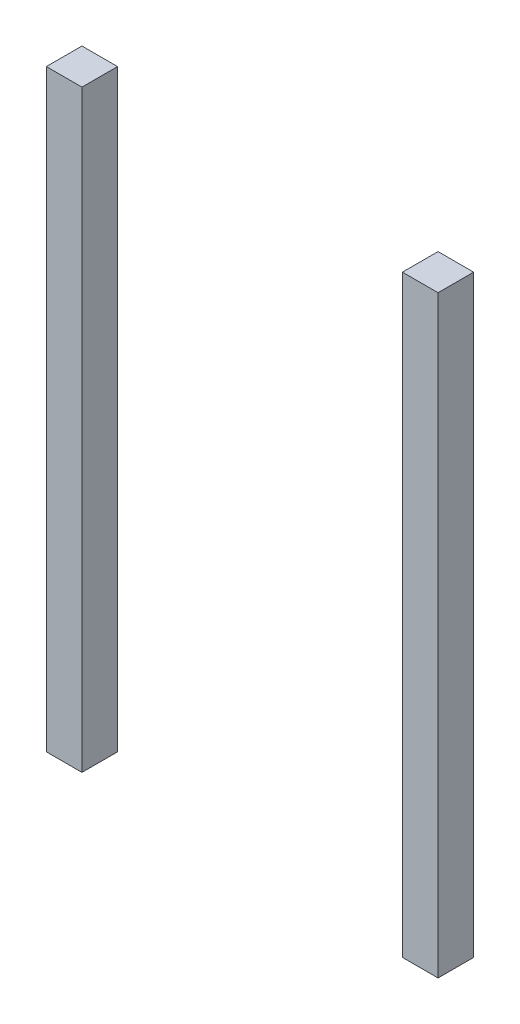
ISO-10303-21;
HEADER;
FILE_DESCRIPTION(('STEP AP214'),'2;1');
FILE_NAME('part.step','',(''),(''),'','','');
FILE_SCHEMA(('AUTOMOTIVE_DESIGN { 1 0 10303 214 1 1 1 1 }'));
ENDSEC;
DATA;
#1=APPLICATION_CONTEXT('core data for automotive mechanical design processes');
#2=APPLICATION_PROTOCOL_DEFINITION('international standard','automotive_design',2000,#1);
#3=PRODUCT_CONTEXT('',#1,'mechanical');
#4=PRODUCT('Part','Part','',(#3));
#5=PRODUCT_RELATED_PRODUCT_CATEGORY('part','',(#4));
#6=PRODUCT_DEFINITION_FORMATION('','',#4);
#7=PRODUCT_DEFINITION_CONTEXT('part definition',#1,'design');
#8=PRODUCT_DEFINITION('design','',#6,#7);
#9=PRODUCT_DEFINITION_SHAPE('','',#8);
#10=(LENGTH_UNIT() NAMED_UNIT(*) SI_UNIT(.MILLI.,.METRE.));
#11=(NAMED_UNIT(*) PLANE_ANGLE_UNIT() SI_UNIT($,.RADIAN.));
#12=(NAMED_UNIT(*) SI_UNIT($,.STERADIAN.) SOLID_ANGLE_UNIT());
#13=UNCERTAINTY_MEASURE_WITH_UNIT(LENGTH_MEASURE(1.E-05),#10,'distance_accuracy_value','');
#14=(GEOMETRIC_REPRESENTATION_CONTEXT(3) GLOBAL_UNCERTAINTY_ASSIGNED_CONTEXT((#13)) GLOBAL_UNIT_ASSIGNED_CONTEXT((#10,
#11,#12)) REPRESENTATION_CONTEXT('',''));
#15=CARTESIAN_POINT('',(0.,0.,0.));
#16=DIRECTION('',(0.,0.,1.));
#17=DIRECTION('',(1.,0.,0.));
#18=AXIS2_PLACEMENT_3D('',#15,#16,#17);
#19=CARTESIAN_POINT('',(135.,250.,30.));
#20=DIRECTION('',(0.,-1.,0.));
#21=DIRECTION('',(0.,0.,-1.));
#22=AXIS2_PLACEMENT_3D('',#19,#20,#21);
#23=PLANE('',#22);
#24=DIRECTION('',(-1.,0.,0.));
#25=VECTOR('',#24,1.);
#26=CARTESIAN_POINT('',(135.,250.,0.));
#27=LINE('',#26,#25);
#28=CARTESIAN_POINT('',(165.,250.,0.));
#29=VERTEX_POINT('',#28);
#30=CARTESIAN_POINT('',(135.,250.,0.));
#31=VERTEX_POINT('',#30);
#32=EDGE_CURVE('E106',#29,#31,#27,.T.);
#33=ORIENTED_EDGE('',*,*,#32,.T.);
#34=DIRECTION('',(0.,0.,-1.));
#35=VECTOR('',#34,1.);
#36=CARTESIAN_POINT('',(135.,250.,30.));
#37=LINE('',#36,#35);
#38=CARTESIAN_POINT('',(135.,250.,30.));
#39=VERTEX_POINT('',#38);
#40=EDGE_CURVE('E12',#39,#31,#37,.T.);
#41=ORIENTED_EDGE('',*,*,#40,.F.);
#42=DIRECTION('',(-1.,0.,0.));
#43=VECTOR('',#42,1.);
#44=CARTESIAN_POINT('',(135.,250.,30.));
#45=LINE('',#44,#43);
#46=CARTESIAN_POINT('',(165.,250.,30.));
#47=VERTEX_POINT('',#46);
#48=EDGE_CURVE('E94',#47,#39,#45,.T.);
#49=ORIENTED_EDGE('',*,*,#48,.F.);
#50=DIRECTION('',(0.,0.,-1.));
#51=VECTOR('',#50,1.);
#52=CARTESIAN_POINT('',(165.,250.,30.));
#53=LINE('',#52,#51);
#54=EDGE_CURVE('E102',#47,#29,#53,.T.);
#55=ORIENTED_EDGE('',*,*,#54,.T.);
#56=EDGE_LOOP('',(#33,#41,#49,#55));
#57=FACE_BOUND('',#56,.T.);
#58=ADVANCED_FACE('F43',(#57),#23,.F.);
#59=CARTESIAN_POINT('',(135.,250.,30.));
#60=DIRECTION('',(1.,0.,0.));
#61=DIRECTION('',(0.,0.,-1.));
#62=AXIS2_PLACEMENT_3D('',#59,#60,#61);
#63=PLANE('',#62);
#64=DIRECTION('',(0.,-1.,0.));
#65=VECTOR('',#64,1.);
#66=CARTESIAN_POINT('',(135.,250.,0.));
#67=LINE('',#66,#65);
#68=CARTESIAN_POINT('',(135.,-250.,0.));
#69=VERTEX_POINT('',#68);
#70=EDGE_CURVE('E98',#31,#69,#67,.T.);
#71=ORIENTED_EDGE('',*,*,#70,.T.);
#72=DIRECTION('',(0.,0.,-1.));
#73=VECTOR('',#72,1.);
#74=CARTESIAN_POINT('',(135.,-250.,30.));
#75=LINE('',#74,#73);
#76=CARTESIAN_POINT('',(135.,-250.,30.));
#77=VERTEX_POINT('',#76);
#78=EDGE_CURVE('E51',#77,#69,#75,.T.);
#79=ORIENTED_EDGE('',*,*,#78,.F.);
#80=DIRECTION('',(0.,-1.,0.));
#81=VECTOR('',#80,1.);
#82=CARTESIAN_POINT('',(135.,250.,30.));
#83=LINE('',#82,#81);
#84=EDGE_CURVE('E89',#39,#77,#83,.T.);
#85=ORIENTED_EDGE('',*,*,#84,.F.);
#86=ORIENTED_EDGE('',*,*,#40,.T.);
#87=EDGE_LOOP('',(#71,#79,#85,#86));
#88=FACE_BOUND('',#87,.T.);
#89=ADVANCED_FACE('F97',(#88),#63,.F.);
#90=CARTESIAN_POINT('',(135.,-250.,30.));
#91=DIRECTION('',(0.,1.,0.));
#92=DIRECTION('',(0.,0.,1.));
#93=AXIS2_PLACEMENT_3D('',#90,#91,#92);
#94=PLANE('',#93);
#95=DIRECTION('',(1.,0.,0.));
#96=VECTOR('',#95,1.);
#97=CARTESIAN_POINT('',(135.,-250.,0.));
#98=LINE('',#97,#96);
#99=CARTESIAN_POINT('',(165.,-250.,0.));
#100=VERTEX_POINT('',#99);
#101=EDGE_CURVE('E76',#69,#100,#98,.T.);
#102=ORIENTED_EDGE('',*,*,#101,.T.);
#103=DIRECTION('',(0.,0.,-1.));
#104=VECTOR('',#103,1.);
#105=CARTESIAN_POINT('',(165.,-250.,30.));
#106=LINE('',#105,#104);
#107=CARTESIAN_POINT('',(165.,-250.,30.));
#108=VERTEX_POINT('',#107);
#109=EDGE_CURVE('E99',#108,#100,#106,.T.);
#110=ORIENTED_EDGE('',*,*,#109,.F.);
#111=DIRECTION('',(1.,0.,0.));
#112=VECTOR('',#111,1.);
#113=CARTESIAN_POINT('',(135.,-250.,30.));
#114=LINE('',#113,#112);
#115=EDGE_CURVE('E92',#77,#108,#114,.T.);
#116=ORIENTED_EDGE('',*,*,#115,.F.);
#117=ORIENTED_EDGE('',*,*,#78,.T.);
#118=EDGE_LOOP('',(#102,#110,#116,#117));
#119=FACE_BOUND('',#118,.T.);
#120=ADVANCED_FACE('F100',(#119),#94,.F.);
#121=CARTESIAN_POINT('',(165.,250.,30.));
#122=DIRECTION('',(-1.,0.,0.));
#123=DIRECTION('',(0.,0.,1.));
#124=AXIS2_PLACEMENT_3D('',#121,#122,#123);
#125=PLANE('',#124);
#126=DIRECTION('',(0.,1.,0.));
#127=VECTOR('',#126,1.);
#128=CARTESIAN_POINT('',(165.,250.,0.));
#129=LINE('',#128,#127);
#130=EDGE_CURVE('E82',#100,#29,#129,.T.);
#131=ORIENTED_EDGE('',*,*,#130,.T.);
#132=ORIENTED_EDGE('',*,*,#54,.F.);
#133=DIRECTION('',(0.,1.,0.));
#134=VECTOR('',#133,1.);
#135=CARTESIAN_POINT('',(165.,250.,30.));
#136=LINE('',#135,#134);
#137=EDGE_CURVE('E59',#108,#47,#136,.T.);
#138=ORIENTED_EDGE('',*,*,#137,.F.);
#139=ORIENTED_EDGE('',*,*,#109,.T.);
#140=EDGE_LOOP('',(#131,#132,#138,#139));
#141=FACE_BOUND('',#140,.T.);
#142=ADVANCED_FACE('F113',(#141),#125,.F.);
#143=CARTESIAN_POINT('',(0.,0.,30.));
#144=DIRECTION('',(0.,0.,-1.));
#145=DIRECTION('',(-1.,0.,0.));
#146=AXIS2_PLACEMENT_3D('',#143,#144,#145);
#147=PLANE('',#146);
#148=ORIENTED_EDGE('',*,*,#48,.T.);
#149=ORIENTED_EDGE('',*,*,#84,.T.);
#150=ORIENTED_EDGE('',*,*,#115,.T.);
#151=ORIENTED_EDGE('',*,*,#137,.T.);
#152=EDGE_LOOP('',(#148,#149,#150,#151));
#153=FACE_BOUND('',#152,.T.);
#154=ADVANCED_FACE('F90',(#153),#147,.F.);
#155=CARTESIAN_POINT('',(0.,0.,0.));
#156=DIRECTION('',(0.,0.,-1.));
#157=DIRECTION('',(-1.,0.,0.));
#158=AXIS2_PLACEMENT_3D('',#155,#156,#157);
#159=PLANE('',#158);
#160=ORIENTED_EDGE('',*,*,#32,.F.);
#161=ORIENTED_EDGE('',*,*,#130,.F.);
#162=ORIENTED_EDGE('',*,*,#101,.F.);
#163=ORIENTED_EDGE('',*,*,#70,.F.);
#164=EDGE_LOOP('',(#160,#161,#162,#163));
#165=FACE_BOUND('',#164,.T.);
#166=ADVANCED_FACE('F116',(#165),#159,.T.);
#167=CLOSED_SHELL('',(#58,#89,#120,#142,#154,#166));
#168=MANIFOLD_SOLID_BREP('B2',#167);
#169=CARTESIAN_POINT('',(-135.,250.,30.));
#170=DIRECTION('',(-1.,0.,0.));
#171=DIRECTION('',(0.,0.,1.));
#172=AXIS2_PLACEMENT_3D('',#169,#170,#171);
#173=PLANE('',#172);
#174=DIRECTION('',(0.,1.,0.));
#175=VECTOR('',#174,1.);
#176=CARTESIAN_POINT('',(-135.,250.,0.));
#177=LINE('',#176,#175);
#178=CARTESIAN_POINT('',(-135.,-250.,0.));
#179=VERTEX_POINT('',#178);
#180=CARTESIAN_POINT('',(-135.,250.,0.));
#181=VERTEX_POINT('',#180);
#182=EDGE_CURVE('E230',#179,#181,#177,.T.);
#183=ORIENTED_EDGE('',*,*,#182,.T.);
#184=DIRECTION('',(0.,0.,-1.));
#185=VECTOR('',#184,1.);
#186=CARTESIAN_POINT('',(-135.,250.,30.));
#187=LINE('',#186,#185);
#188=CARTESIAN_POINT('',(-135.,250.,30.));
#189=VERTEX_POINT('',#188);
#190=EDGE_CURVE('E41',#189,#181,#187,.T.);
#191=ORIENTED_EDGE('',*,*,#190,.F.);
#192=DIRECTION('',(0.,1.,0.));
#193=VECTOR('',#192,1.);
#194=CARTESIAN_POINT('',(-135.,250.,30.));
#195=LINE('',#194,#193);
#196=CARTESIAN_POINT('',(-135.,-250.,30.));
#197=VERTEX_POINT('',#196);
#198=EDGE_CURVE('E218',#197,#189,#195,.T.);
#199=ORIENTED_EDGE('',*,*,#198,.F.);
#200=DIRECTION('',(0.,0.,-1.));
#201=VECTOR('',#200,1.);
#202=CARTESIAN_POINT('',(-135.,-250.,30.));
#203=LINE('',#202,#201);
#204=EDGE_CURVE('E226',#197,#179,#203,.T.);
#205=ORIENTED_EDGE('',*,*,#204,.T.);
#206=EDGE_LOOP('',(#183,#191,#199,#205));
#207=FACE_BOUND('',#206,.T.);
#208=ADVANCED_FACE('F167',(#207),#173,.F.);
#209=CARTESIAN_POINT('',(-135.,250.,30.));
#210=DIRECTION('',(0.,-1.,0.));
#211=DIRECTION('',(0.,0.,-1.));
#212=AXIS2_PLACEMENT_3D('',#209,#210,#211);
#213=PLANE('',#212);
#214=DIRECTION('',(-1.,0.,0.));
#215=VECTOR('',#214,1.);
#216=CARTESIAN_POINT('',(-135.,250.,0.));
#217=LINE('',#216,#215);
#218=CARTESIAN_POINT('',(-165.,250.,0.));
#219=VERTEX_POINT('',#218);
#220=EDGE_CURVE('E222',#181,#219,#217,.T.);
#221=ORIENTED_EDGE('',*,*,#220,.T.);
#222=DIRECTION('',(0.,0.,-1.));
#223=VECTOR('',#222,1.);
#224=CARTESIAN_POINT('',(-165.,250.,30.));
#225=LINE('',#224,#223);
#226=CARTESIAN_POINT('',(-165.,250.,30.));
#227=VERTEX_POINT('',#226);
#228=EDGE_CURVE('E175',#227,#219,#225,.T.);
#229=ORIENTED_EDGE('',*,*,#228,.F.);
#230=DIRECTION('',(-1.,0.,0.));
#231=VECTOR('',#230,1.);
#232=CARTESIAN_POINT('',(-135.,250.,30.));
#233=LINE('',#232,#231);
#234=EDGE_CURVE('E213',#189,#227,#233,.T.);
#235=ORIENTED_EDGE('',*,*,#234,.F.);
#236=ORIENTED_EDGE('',*,*,#190,.T.);
#237=EDGE_LOOP('',(#221,#229,#235,#236));
#238=FACE_BOUND('',#237,.T.);
#239=ADVANCED_FACE('F221',(#238),#213,.F.);
#240=CARTESIAN_POINT('',(-165.,250.,30.));
#241=DIRECTION('',(1.,0.,0.));
#242=DIRECTION('',(0.,1.,0.));
#243=AXIS2_PLACEMENT_3D('',#240,#241,#242);
#244=PLANE('',#243);
#245=DIRECTION('',(0.,-1.,0.));
#246=VECTOR('',#245,1.);
#247=CARTESIAN_POINT('',(-165.,250.,0.));
#248=LINE('',#247,#246);
#249=CARTESIAN_POINT('',(-165.,-250.,0.));
#250=VERTEX_POINT('',#249);
#251=EDGE_CURVE('E200',#219,#250,#248,.T.);
#252=ORIENTED_EDGE('',*,*,#251,.T.);
#253=DIRECTION('',(0.,0.,-1.));
#254=VECTOR('',#253,1.);
#255=CARTESIAN_POINT('',(-165.,-250.,30.));
#256=LINE('',#255,#254);
#257=CARTESIAN_POINT('',(-165.,-250.,30.));
#258=VERTEX_POINT('',#257);
#259=EDGE_CURVE('E223',#258,#250,#256,.T.);
#260=ORIENTED_EDGE('',*,*,#259,.F.);
#261=DIRECTION('',(0.,-1.,0.));
#262=VECTOR('',#261,1.);
#263=CARTESIAN_POINT('',(-165.,250.,30.));
#264=LINE('',#263,#262);
#265=EDGE_CURVE('E216',#227,#258,#264,.T.);
#266=ORIENTED_EDGE('',*,*,#265,.F.);
#267=ORIENTED_EDGE('',*,*,#228,.T.);
#268=EDGE_LOOP('',(#252,#260,#266,#267));
#269=FACE_BOUND('',#268,.T.);
#270=ADVANCED_FACE('F224',(#269),#244,.F.);
#271=CARTESIAN_POINT('',(-135.,-250.,30.));
#272=DIRECTION('',(0.,1.,0.));
#273=DIRECTION('',(0.,0.,1.));
#274=AXIS2_PLACEMENT_3D('',#271,#272,#273);
#275=PLANE('',#274);
#276=DIRECTION('',(1.,0.,0.));
#277=VECTOR('',#276,1.);
#278=CARTESIAN_POINT('',(-135.,-250.,0.));
#279=LINE('',#278,#277);
#280=EDGE_CURVE('E206',#250,#179,#279,.T.);
#281=ORIENTED_EDGE('',*,*,#280,.T.);
#282=ORIENTED_EDGE('',*,*,#204,.F.);
#283=DIRECTION('',(1.,0.,0.));
#284=VECTOR('',#283,1.);
#285=CARTESIAN_POINT('',(-135.,-250.,30.));
#286=LINE('',#285,#284);
#287=EDGE_CURVE('E183',#258,#197,#286,.T.);
#288=ORIENTED_EDGE('',*,*,#287,.F.);
#289=ORIENTED_EDGE('',*,*,#259,.T.);
#290=EDGE_LOOP('',(#281,#282,#288,#289));
#291=FACE_BOUND('',#290,.T.);
#292=ADVANCED_FACE('F237',(#291),#275,.F.);
#293=CARTESIAN_POINT('',(0.,0.,30.));
#294=DIRECTION('',(0.,0.,-1.));
#295=DIRECTION('',(-1.,0.,0.));
#296=AXIS2_PLACEMENT_3D('',#293,#294,#295);
#297=PLANE('',#296);
#298=ORIENTED_EDGE('',*,*,#198,.T.);
#299=ORIENTED_EDGE('',*,*,#234,.T.);
#300=ORIENTED_EDGE('',*,*,#265,.T.);
#301=ORIENTED_EDGE('',*,*,#287,.T.);
#302=EDGE_LOOP('',(#298,#299,#300,#301));
#303=FACE_BOUND('',#302,.T.);
#304=ADVANCED_FACE('F214',(#303),#297,.F.);
#305=CARTESIAN_POINT('',(0.,0.,0.));
#306=DIRECTION('',(0.,0.,-1.));
#307=DIRECTION('',(-1.,0.,0.));
#308=AXIS2_PLACEMENT_3D('',#305,#306,#307);
#309=PLANE('',#308);
#310=ORIENTED_EDGE('',*,*,#182,.F.);
#311=ORIENTED_EDGE('',*,*,#280,.F.);
#312=ORIENTED_EDGE('',*,*,#251,.F.);
#313=ORIENTED_EDGE('',*,*,#220,.F.);
#314=EDGE_LOOP('',(#310,#311,#312,#313));
#315=FACE_BOUND('',#314,.T.);
#316=ADVANCED_FACE('F240',(#315),#309,.T.);
#317=CLOSED_SHELL('',(#208,#239,#270,#292,#304,#316));
#318=MANIFOLD_SOLID_BREP('B6',#317);
#319=ADVANCED_BREP_SHAPE_REPRESENTATION('',(#18,#168,#318),#14);
#320=SHAPE_DEFINITION_REPRESENTATION(#9,#319);
ENDSEC;
END-ISO-10303-21;
